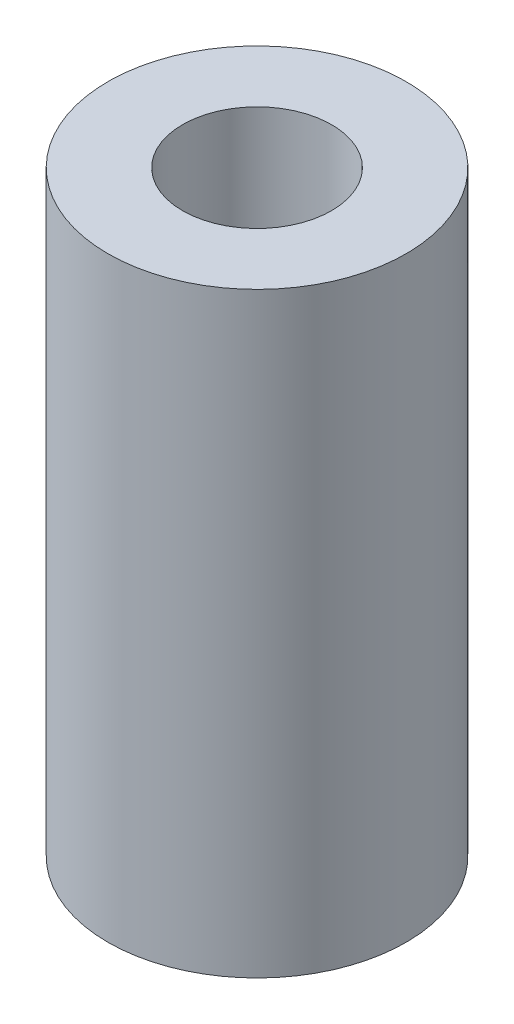
ISO-10303-21;
HEADER;
FILE_DESCRIPTION(('STEP AP214'),'2;1');
FILE_NAME('part.step','',(''),(''),'','','');
FILE_SCHEMA(('AUTOMOTIVE_DESIGN { 1 0 10303 214 1 1 1 1 }'));
ENDSEC;
DATA;
#1=APPLICATION_CONTEXT('core data for automotive mechanical design processes');
#2=APPLICATION_PROTOCOL_DEFINITION('international standard','automotive_design',2000,#1);
#3=PRODUCT_CONTEXT('',#1,'mechanical');
#4=PRODUCT('Part','Part','',(#3));
#5=PRODUCT_RELATED_PRODUCT_CATEGORY('part','',(#4));
#6=PRODUCT_DEFINITION_FORMATION('','',#4);
#7=PRODUCT_DEFINITION_CONTEXT('part definition',#1,'design');
#8=PRODUCT_DEFINITION('design','',#6,#7);
#9=PRODUCT_DEFINITION_SHAPE('','',#8);
#10=(LENGTH_UNIT() NAMED_UNIT(*) SI_UNIT(.MILLI.,.METRE.));
#11=(NAMED_UNIT(*) PLANE_ANGLE_UNIT() SI_UNIT($,.RADIAN.));
#12=(NAMED_UNIT(*) SI_UNIT($,.STERADIAN.) SOLID_ANGLE_UNIT());
#13=UNCERTAINTY_MEASURE_WITH_UNIT(LENGTH_MEASURE(1.E-05),#10,'distance_accuracy_value','');
#14=(GEOMETRIC_REPRESENTATION_CONTEXT(3) GLOBAL_UNCERTAINTY_ASSIGNED_CONTEXT((#13)) GLOBAL_UNIT_ASSIGNED_CONTEXT((#10,
#11,#12)) REPRESENTATION_CONTEXT('',''));
#15=CARTESIAN_POINT('',(0.,0.,0.));
#16=DIRECTION('',(0.,0.,1.));
#17=DIRECTION('',(1.,0.,0.));
#18=AXIS2_PLACEMENT_3D('',#15,#16,#17);
#19=CARTESIAN_POINT('',(0.,25.4,0.));
#20=DIRECTION('',(0.,1.,0.));
#21=DIRECTION('',(0.,0.,1.));
#22=AXIS2_PLACEMENT_3D('',#19,#20,#21);
#23=PLANE('',#22);
#24=CARTESIAN_POINT('',(0.,25.4,0.));
#25=DIRECTION('',(0.,1.,0.));
#26=DIRECTION('',(0.,0.,1.));
#27=AXIS2_PLACEMENT_3D('',#24,#25,#26);
#28=CIRCLE('',#27,6.35);
#29=CARTESIAN_POINT('',(0.,25.4,6.35));
#30=VERTEX_POINT('',#29);
#31=EDGE_CURVE('E10',#30,#30,#28,.T.);
#32=ORIENTED_EDGE('',*,*,#31,.T.);
#33=EDGE_LOOP('',(#32));
#34=FACE_BOUND('',#33,.T.);
#35=CARTESIAN_POINT('',(0.,25.4,0.));
#36=DIRECTION('',(0.,1.,0.));
#37=DIRECTION('',(0.,0.,1.));
#38=AXIS2_PLACEMENT_3D('',#35,#36,#37);
#39=CIRCLE('',#38,3.175);
#40=CARTESIAN_POINT('',(0.,25.4,3.175));
#41=VERTEX_POINT('',#40);
#42=EDGE_CURVE('E49',#41,#41,#39,.T.);
#43=ORIENTED_EDGE('',*,*,#42,.F.);
#44=EDGE_LOOP('',(#43));
#45=FACE_BOUND('',#44,.T.);
#46=ADVANCED_FACE('F34',(#34,#45),#23,.T.);
#47=CARTESIAN_POINT('',(0.,0.,0.));
#48=DIRECTION('',(0.,1.,0.));
#49=DIRECTION('',(0.,0.,1.));
#50=AXIS2_PLACEMENT_3D('',#47,#48,#49);
#51=PLANE('',#50);
#52=CARTESIAN_POINT('',(0.,0.,0.));
#53=DIRECTION('',(0.,1.,0.));
#54=DIRECTION('',(0.,0.,1.));
#55=AXIS2_PLACEMENT_3D('',#52,#53,#54);
#56=CIRCLE('',#55,6.35);
#57=CARTESIAN_POINT('',(0.,0.,6.35));
#58=VERTEX_POINT('',#57);
#59=EDGE_CURVE('E38',#58,#58,#56,.T.);
#60=ORIENTED_EDGE('',*,*,#59,.F.);
#61=EDGE_LOOP('',(#60));
#62=FACE_BOUND('',#61,.T.);
#63=CARTESIAN_POINT('',(0.,0.,0.));
#64=DIRECTION('',(0.,1.,0.));
#65=DIRECTION('',(0.,0.,1.));
#66=AXIS2_PLACEMENT_3D('',#63,#64,#65);
#67=CIRCLE('',#66,3.175);
#68=CARTESIAN_POINT('',(0.,0.,3.175));
#69=VERTEX_POINT('',#68);
#70=EDGE_CURVE('E51',#69,#69,#67,.T.);
#71=ORIENTED_EDGE('',*,*,#70,.T.);
#72=EDGE_LOOP('',(#71));
#73=FACE_BOUND('',#72,.T.);
#74=ADVANCED_FACE('F61',(#62,#73),#51,.F.);
#75=CARTESIAN_POINT('',(0.,25.4,0.));
#76=DIRECTION('',(0.,-1.,0.));
#77=DIRECTION('',(0.,0.,-1.));
#78=AXIS2_PLACEMENT_3D('',#75,#76,#77);
#79=CYLINDRICAL_SURFACE('',#78,6.35);
#80=ORIENTED_EDGE('',*,*,#31,.F.);
#81=EDGE_LOOP('',(#80));
#82=FACE_BOUND('',#81,.T.);
#83=ORIENTED_EDGE('',*,*,#59,.T.);
#84=EDGE_LOOP('',(#83));
#85=FACE_BOUND('',#84,.T.);
#86=ADVANCED_FACE('F36',(#82,#85),#79,.T.);
#87=CARTESIAN_POINT('',(0.,25.4,0.));
#88=DIRECTION('',(0.,-1.,0.));
#89=DIRECTION('',(0.,0.,-1.));
#90=AXIS2_PLACEMENT_3D('',#87,#88,#89);
#91=CYLINDRICAL_SURFACE('',#90,3.175);
#92=ORIENTED_EDGE('',*,*,#42,.T.);
#93=EDGE_LOOP('',(#92));
#94=FACE_BOUND('',#93,.T.);
#95=ORIENTED_EDGE('',*,*,#70,.F.);
#96=EDGE_LOOP('',(#95));
#97=FACE_BOUND('',#96,.T.);
#98=ADVANCED_FACE('F57',(#94,#97),#91,.F.);
#99=CLOSED_SHELL('',(#46,#74,#86,#98));
#100=MANIFOLD_SOLID_BREP('B2',#99);
#101=ADVANCED_BREP_SHAPE_REPRESENTATION('',(#18,#100),#14);
#102=SHAPE_DEFINITION_REPRESENTATION(#9,#101);
ENDSEC;
END-ISO-10303-21;
